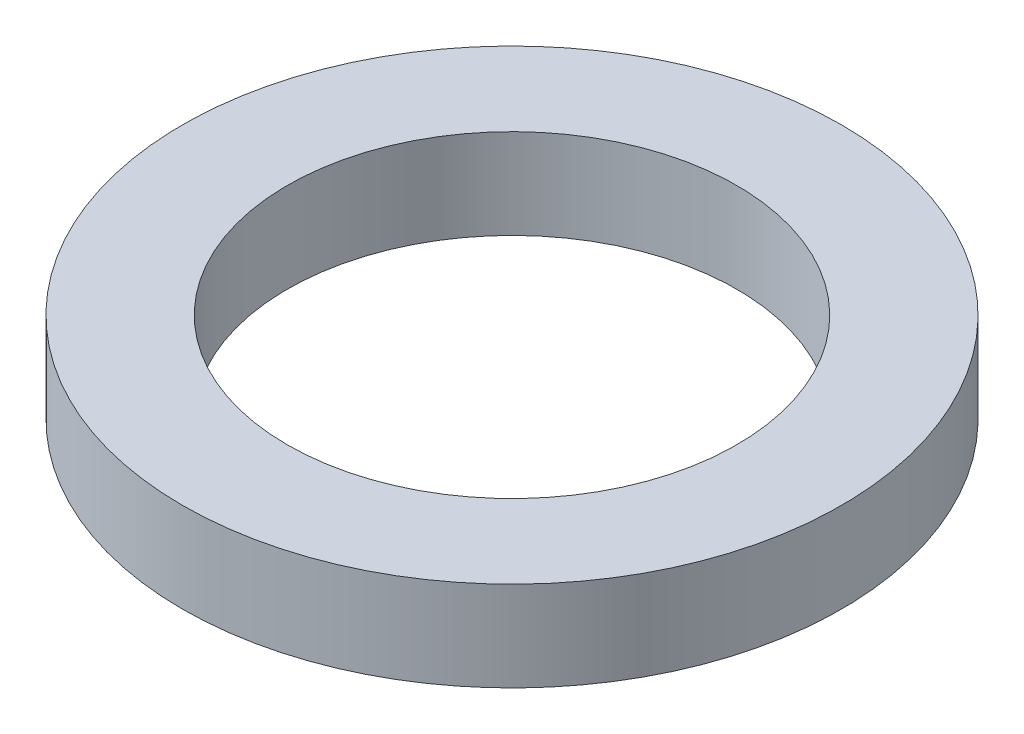
ISO-10303-21;
HEADER;
FILE_DESCRIPTION(('STEP AP214'),'2;1');
FILE_NAME('part.step','',(''),(''),'','','');
FILE_SCHEMA(('AUTOMOTIVE_DESIGN { 1 0 10303 214 1 1 1 1 }'));
ENDSEC;
DATA;
#1=APPLICATION_CONTEXT('core data for automotive mechanical design processes');
#2=APPLICATION_PROTOCOL_DEFINITION('international standard','automotive_design',2000,#1);
#3=PRODUCT_CONTEXT('',#1,'mechanical');
#4=PRODUCT('Part','Part','',(#3));
#5=PRODUCT_RELATED_PRODUCT_CATEGORY('part','',(#4));
#6=PRODUCT_DEFINITION_FORMATION('','',#4);
#7=PRODUCT_DEFINITION_CONTEXT('part definition',#1,'design');
#8=PRODUCT_DEFINITION('design','',#6,#7);
#9=PRODUCT_DEFINITION_SHAPE('','',#8);
#10=(LENGTH_UNIT() NAMED_UNIT(*) SI_UNIT(.MILLI.,.METRE.));
#11=(NAMED_UNIT(*) PLANE_ANGLE_UNIT() SI_UNIT($,.RADIAN.));
#12=(NAMED_UNIT(*) SI_UNIT($,.STERADIAN.) SOLID_ANGLE_UNIT());
#13=UNCERTAINTY_MEASURE_WITH_UNIT(LENGTH_MEASURE(1.E-05),#10,'distance_accuracy_value','');
#14=(GEOMETRIC_REPRESENTATION_CONTEXT(3) GLOBAL_UNCERTAINTY_ASSIGNED_CONTEXT((#13)) GLOBAL_UNIT_ASSIGNED_CONTEXT((#10,
#11,#12)) REPRESENTATION_CONTEXT('',''));
#15=CARTESIAN_POINT('',(0.,0.,0.));
#16=DIRECTION('',(0.,0.,1.));
#17=DIRECTION('',(1.,0.,0.));
#18=AXIS2_PLACEMENT_3D('',#15,#16,#17);
#19=CARTESIAN_POINT('',(0.,3.,0.));
#20=DIRECTION('',(0.,1.,0.));
#21=DIRECTION('',(0.,0.,1.));
#22=AXIS2_PLACEMENT_3D('',#19,#20,#21);
#23=PLANE('',#22);
#24=CARTESIAN_POINT('',(0.,3.,0.));
#25=DIRECTION('',(0.,1.,0.));
#26=DIRECTION('',(0.,0.,1.));
#27=AXIS2_PLACEMENT_3D('',#24,#25,#26);
#28=CIRCLE('',#27,7.5);
#29=CARTESIAN_POINT('',(0.,3.,7.5));
#30=VERTEX_POINT('',#29);
#31=EDGE_CURVE('E27',#30,#30,#28,.F.);
#32=ORIENTED_EDGE('',*,*,#31,.T.);
#33=EDGE_LOOP('',(#32));
#34=FACE_BOUND('',#33,.T.);
#35=CARTESIAN_POINT('',(0.,3.,0.));
#36=DIRECTION('',(0.,1.,0.));
#37=DIRECTION('',(0.,0.,1.));
#38=AXIS2_PLACEMENT_3D('',#35,#36,#37);
#39=CIRCLE('',#38,11.);
#40=CARTESIAN_POINT('',(0.,3.,11.));
#41=VERTEX_POINT('',#40);
#42=EDGE_CURVE('E18',#41,#41,#39,.F.);
#43=ORIENTED_EDGE('',*,*,#42,.F.);
#44=EDGE_LOOP('',(#43));
#45=FACE_BOUND('',#44,.T.);
#46=ADVANCED_FACE('F15',(#34,#45),#23,.T.);
#47=CARTESIAN_POINT('',(0.,0.,0.));
#48=DIRECTION('',(0.,1.,0.));
#49=DIRECTION('',(0.,0.,1.));
#50=AXIS2_PLACEMENT_3D('',#47,#48,#49);
#51=CYLINDRICAL_SURFACE('',#50,11.);
#52=ORIENTED_EDGE('',*,*,#42,.T.);
#53=EDGE_LOOP('',(#52));
#54=FACE_BOUND('',#53,.T.);
#55=CARTESIAN_POINT('',(0.,0.,0.));
#56=DIRECTION('',(0.,1.,0.));
#57=DIRECTION('',(0.,0.,1.));
#58=AXIS2_PLACEMENT_3D('',#55,#56,#57);
#59=CIRCLE('',#58,11.);
#60=CARTESIAN_POINT('',(0.,0.,11.));
#61=VERTEX_POINT('',#60);
#62=EDGE_CURVE('E22',#61,#61,#59,.T.);
#63=ORIENTED_EDGE('',*,*,#62,.T.);
#64=EDGE_LOOP('',(#63));
#65=FACE_BOUND('',#64,.T.);
#66=ADVANCED_FACE('F35',(#54,#65),#51,.T.);
#67=CARTESIAN_POINT('',(0.,0.,0.));
#68=DIRECTION('',(0.,1.,0.));
#69=DIRECTION('',(0.,0.,1.));
#70=AXIS2_PLACEMENT_3D('',#67,#68,#69);
#71=CYLINDRICAL_SURFACE('',#70,7.5);
#72=ORIENTED_EDGE('',*,*,#31,.F.);
#73=EDGE_LOOP('',(#72));
#74=FACE_BOUND('',#73,.T.);
#75=CARTESIAN_POINT('',(0.,0.,0.));
#76=DIRECTION('',(0.,1.,0.));
#77=DIRECTION('',(0.,0.,1.));
#78=AXIS2_PLACEMENT_3D('',#75,#76,#77);
#79=CIRCLE('',#78,7.5);
#80=CARTESIAN_POINT('',(0.,0.,7.5));
#81=VERTEX_POINT('',#80);
#82=EDGE_CURVE('E10',#81,#81,#79,.F.);
#83=ORIENTED_EDGE('',*,*,#82,.T.);
#84=EDGE_LOOP('',(#83));
#85=FACE_BOUND('',#84,.T.);
#86=ADVANCED_FACE('F43',(#74,#85),#71,.F.);
#87=CARTESIAN_POINT('',(0.,0.,0.));
#88=DIRECTION('',(0.,1.,0.));
#89=DIRECTION('',(0.,0.,1.));
#90=AXIS2_PLACEMENT_3D('',#87,#88,#89);
#91=PLANE('',#90);
#92=ORIENTED_EDGE('',*,*,#82,.F.);
#93=EDGE_LOOP('',(#92));
#94=FACE_BOUND('',#93,.T.);
#95=ORIENTED_EDGE('',*,*,#62,.F.);
#96=EDGE_LOOP('',(#95));
#97=FACE_BOUND('',#96,.T.);
#98=ADVANCED_FACE('F44',(#94,#97),#91,.F.);
#99=CLOSED_SHELL('',(#46,#66,#86,#98));
#100=MANIFOLD_SOLID_BREP('B1',#99);
#101=ADVANCED_BREP_SHAPE_REPRESENTATION('',(#18,#100),#14);
#102=SHAPE_DEFINITION_REPRESENTATION(#9,#101);
ENDSEC;
END-ISO-10303-21;
